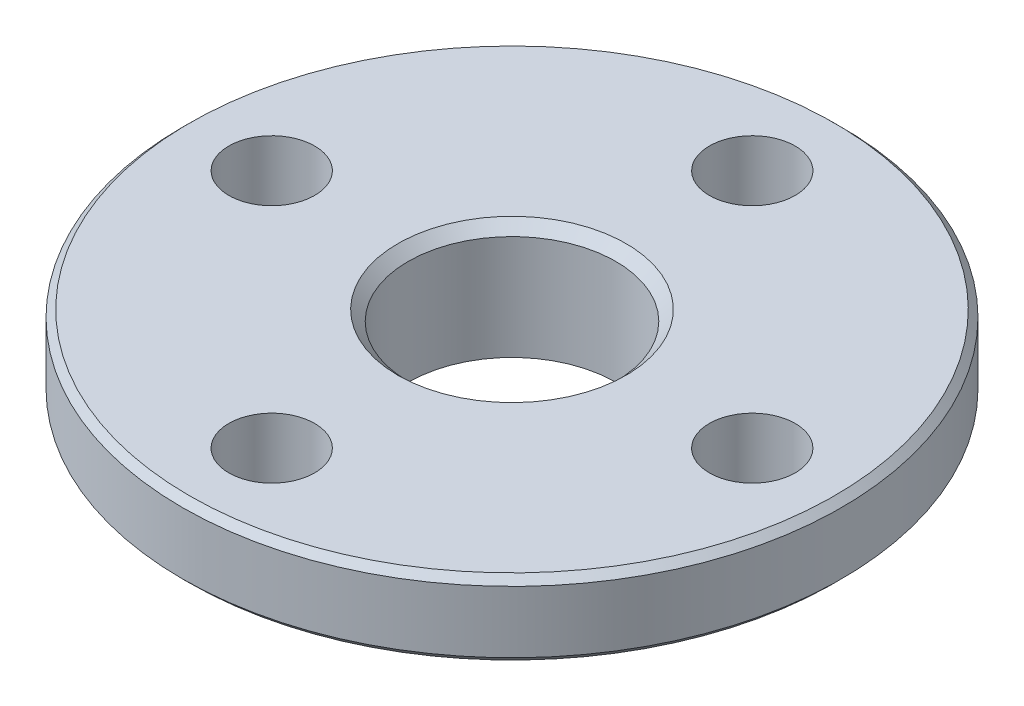
ISO-10303-21;
HEADER;
FILE_DESCRIPTION(('STEP AP214'),'2;1');
FILE_NAME('part.step','',(''),(''),'','','');
FILE_SCHEMA(('AUTOMOTIVE_DESIGN { 1 0 10303 214 1 1 1 1 }'));
ENDSEC;
DATA;
#1=APPLICATION_CONTEXT('core data for automotive mechanical design processes');
#2=APPLICATION_PROTOCOL_DEFINITION('international standard','automotive_design',2000,#1);
#3=PRODUCT_CONTEXT('',#1,'mechanical');
#4=PRODUCT('Part','Part','',(#3));
#5=PRODUCT_RELATED_PRODUCT_CATEGORY('part','',(#4));
#6=PRODUCT_DEFINITION_FORMATION('','',#4);
#7=PRODUCT_DEFINITION_CONTEXT('part definition',#1,'design');
#8=PRODUCT_DEFINITION('design','',#6,#7);
#9=PRODUCT_DEFINITION_SHAPE('','',#8);
#10=(LENGTH_UNIT() NAMED_UNIT(*) SI_UNIT(.MILLI.,.METRE.));
#11=(NAMED_UNIT(*) PLANE_ANGLE_UNIT() SI_UNIT($,.RADIAN.));
#12=(NAMED_UNIT(*) SI_UNIT($,.STERADIAN.) SOLID_ANGLE_UNIT());
#13=UNCERTAINTY_MEASURE_WITH_UNIT(LENGTH_MEASURE(1.E-05),#10,'distance_accuracy_value','');
#14=(GEOMETRIC_REPRESENTATION_CONTEXT(3) GLOBAL_UNCERTAINTY_ASSIGNED_CONTEXT((#13)) GLOBAL_UNIT_ASSIGNED_CONTEXT((#10,
#11,#12)) REPRESENTATION_CONTEXT('',''));
#15=CARTESIAN_POINT('',(0.,0.,0.));
#16=DIRECTION('',(0.,0.,1.));
#17=DIRECTION('',(1.,0.,0.));
#18=AXIS2_PLACEMENT_3D('',#15,#16,#17);
#19=CARTESIAN_POINT('',(3.0000018731,-21.738,0.));
#20=DIRECTION('',(0.,-1.,0.));
#21=DIRECTION('',(0.,0.,1.));
#22=AXIS2_PLACEMENT_3D('',#19,#20,#21);
#23=CYLINDRICAL_SURFACE('',#22,1.25);
#24=CARTESIAN_POINT('',(3.0000018731,-21.8,0.));
#25=DIRECTION('',(0.,1.,0.));
#26=DIRECTION('',(0.,0.,-1.));
#27=AXIS2_PLACEMENT_3D('',#24,#25,#26);
#28=CIRCLE('',#27,1.25);
#29=CARTESIAN_POINT('',(3.0000018731,-21.8,-1.25));
#30=VERTEX_POINT('',#29);
#31=EDGE_CURVE('E198',#30,#30,#28,.T.);
#32=ORIENTED_EDGE('',*,*,#31,.T.);
#33=DIRECTION('',(0.,-1.,0.));
#34=VECTOR('',#33,1.);
#35=CARTESIAN_POINT('',(3.0000018731,-21.738,-1.25));
#36=LINE('',#35,#34);
#37=CARTESIAN_POINT('',(3.0000018731,-24.,-1.25));
#38=VERTEX_POINT('',#37);
#39=EDGE_CURVE('E11',#30,#38,#36,.T.);
#40=ORIENTED_EDGE('',*,*,#39,.T.);
#41=CARTESIAN_POINT('',(3.0000018731,-24.,0.));
#42=DIRECTION('',(0.,-1.,0.));
#43=DIRECTION('',(0.,0.,1.));
#44=AXIS2_PLACEMENT_3D('',#41,#42,#43);
#45=CIRCLE('',#44,1.25);
#46=EDGE_CURVE('E209',#38,#38,#45,.T.);
#47=ORIENTED_EDGE('',*,*,#46,.T.);
#48=ORIENTED_EDGE('',*,*,#39,.F.);
#49=EDGE_LOOP('',(#32,#40,#47,#48));
#50=FACE_BOUND('',#49,.T.);
#51=ADVANCED_FACE('F17',(#50),#23,.F.);
#52=CARTESIAN_POINT('',(10.,-21.738,6.9999981269));
#53=DIRECTION('',(0.,-1.,0.));
#54=DIRECTION('',(1.,0.,0.));
#55=AXIS2_PLACEMENT_3D('',#52,#53,#54);
#56=CYLINDRICAL_SURFACE('',#55,1.25);
#57=CARTESIAN_POINT('',(10.,-21.8,6.9999981269));
#58=DIRECTION('',(0.,1.,0.));
#59=DIRECTION('',(-1.,0.,0.));
#60=AXIS2_PLACEMENT_3D('',#57,#58,#59);
#61=CIRCLE('',#60,1.25);
#62=CARTESIAN_POINT('',(8.75,-21.8,6.9999981269));
#63=VERTEX_POINT('',#62);
#64=EDGE_CURVE('E166',#63,#63,#61,.T.);
#65=ORIENTED_EDGE('',*,*,#64,.T.);
#66=DIRECTION('',(0.,-1.,0.));
#67=VECTOR('',#66,1.);
#68=CARTESIAN_POINT('',(8.75,-21.738,6.9999981269));
#69=LINE('',#68,#67);
#70=CARTESIAN_POINT('',(8.75,-24.,6.9999981269));
#71=VERTEX_POINT('',#70);
#72=EDGE_CURVE('E28',#63,#71,#69,.T.);
#73=ORIENTED_EDGE('',*,*,#72,.T.);
#74=CARTESIAN_POINT('',(10.,-24.,6.9999981269));
#75=DIRECTION('',(0.,-1.,0.));
#76=DIRECTION('',(1.,0.,0.));
#77=AXIS2_PLACEMENT_3D('',#74,#75,#76);
#78=CIRCLE('',#77,1.25);
#79=EDGE_CURVE('E226',#71,#71,#78,.T.);
#80=ORIENTED_EDGE('',*,*,#79,.T.);
#81=ORIENTED_EDGE('',*,*,#72,.F.);
#82=EDGE_LOOP('',(#65,#73,#80,#81));
#83=FACE_BOUND('',#82,.T.);
#84=ADVANCED_FACE('F238',(#83),#56,.F.);
#85=CARTESIAN_POINT('',(16.9999981269,-21.738,0.));
#86=DIRECTION('',(0.,-1.,0.));
#87=DIRECTION('',(0.,0.,-1.));
#88=AXIS2_PLACEMENT_3D('',#85,#86,#87);
#89=CYLINDRICAL_SURFACE('',#88,1.25);
#90=CARTESIAN_POINT('',(16.9999981269,-21.8,0.));
#91=DIRECTION('',(0.,1.,0.));
#92=DIRECTION('',(0.,0.,1.));
#93=AXIS2_PLACEMENT_3D('',#90,#91,#92);
#94=CIRCLE('',#93,1.25);
#95=CARTESIAN_POINT('',(16.9999981269,-21.8,1.25));
#96=VERTEX_POINT('',#95);
#97=EDGE_CURVE('E155',#96,#96,#94,.T.);
#98=ORIENTED_EDGE('',*,*,#97,.T.);
#99=DIRECTION('',(0.,-1.,0.));
#100=VECTOR('',#99,1.);
#101=CARTESIAN_POINT('',(16.9999981269,-21.738,1.25));
#102=LINE('',#101,#100);
#103=CARTESIAN_POINT('',(16.9999981269,-24.,1.25));
#104=VERTEX_POINT('',#103);
#105=EDGE_CURVE('E169',#96,#104,#102,.T.);
#106=ORIENTED_EDGE('',*,*,#105,.T.);
#107=CARTESIAN_POINT('',(16.9999981269,-24.,0.));
#108=DIRECTION('',(0.,-1.,0.));
#109=DIRECTION('',(0.,0.,-1.));
#110=AXIS2_PLACEMENT_3D('',#107,#108,#109);
#111=CIRCLE('',#110,1.25);
#112=EDGE_CURVE('E183',#104,#104,#111,.T.);
#113=ORIENTED_EDGE('',*,*,#112,.T.);
#114=ORIENTED_EDGE('',*,*,#105,.F.);
#115=EDGE_LOOP('',(#98,#106,#113,#114));
#116=FACE_BOUND('',#115,.T.);
#117=ADVANCED_FACE('F278',(#116),#89,.F.);
#118=CARTESIAN_POINT('',(10.,-21.738,-6.9999981269));
#119=DIRECTION('',(0.,-1.,0.));
#120=DIRECTION('',(-1.,0.,0.));
#121=AXIS2_PLACEMENT_3D('',#118,#119,#120);
#122=CYLINDRICAL_SURFACE('',#121,1.25);
#123=CARTESIAN_POINT('',(10.,-21.8,-6.9999981269));
#124=DIRECTION('',(0.,1.,0.));
#125=DIRECTION('',(1.,0.,0.));
#126=AXIS2_PLACEMENT_3D('',#123,#124,#125);
#127=CIRCLE('',#126,1.25);
#128=CARTESIAN_POINT('',(11.25,-21.8,-6.9999981269));
#129=VERTEX_POINT('',#128);
#130=EDGE_CURVE('E194',#129,#129,#127,.T.);
#131=ORIENTED_EDGE('',*,*,#130,.T.);
#132=DIRECTION('',(0.,-1.,0.));
#133=VECTOR('',#132,1.);
#134=CARTESIAN_POINT('',(11.25,-21.738,-6.9999981269));
#135=LINE('',#134,#133);
#136=CARTESIAN_POINT('',(11.25,-24.,-6.9999981269));
#137=VERTEX_POINT('',#136);
#138=EDGE_CURVE('E203',#129,#137,#135,.T.);
#139=ORIENTED_EDGE('',*,*,#138,.T.);
#140=CARTESIAN_POINT('',(10.,-24.,-6.9999981269));
#141=DIRECTION('',(0.,-1.,0.));
#142=DIRECTION('',(-1.,0.,0.));
#143=AXIS2_PLACEMENT_3D('',#140,#141,#142);
#144=CIRCLE('',#143,1.25);
#145=EDGE_CURVE('E180',#137,#137,#144,.T.);
#146=ORIENTED_EDGE('',*,*,#145,.T.);
#147=ORIENTED_EDGE('',*,*,#138,.F.);
#148=EDGE_LOOP('',(#131,#139,#146,#147));
#149=FACE_BOUND('',#148,.T.);
#150=ADVANCED_FACE('F243',(#149),#122,.F.);
#151=CARTESIAN_POINT('',(10.,-24.,0.));
#152=DIRECTION('',(0.,1.,0.));
#153=DIRECTION('',(1.,0.,0.));
#154=AXIS2_PLACEMENT_3D('',#151,#152,#153);
#155=PLANE('',#154);
#156=ORIENTED_EDGE('',*,*,#46,.F.);
#157=EDGE_LOOP('',(#156));
#158=FACE_BOUND('',#157,.T.);
#159=ORIENTED_EDGE('',*,*,#79,.F.);
#160=EDGE_LOOP('',(#159));
#161=FACE_BOUND('',#160,.T.);
#162=ORIENTED_EDGE('',*,*,#112,.F.);
#163=EDGE_LOOP('',(#162));
#164=FACE_BOUND('',#163,.T.);
#165=ORIENTED_EDGE('',*,*,#145,.F.);
#166=EDGE_LOOP('',(#165));
#167=FACE_BOUND('',#166,.T.);
#168=CARTESIAN_POINT('',(10.,-24.,0.));
#169=DIRECTION('',(0.,1.,0.));
#170=DIRECTION('',(1.,0.,0.));
#171=AXIS2_PLACEMENT_3D('',#168,#169,#170);
#172=CIRCLE('',#171,4.46);
#173=CARTESIAN_POINT('',(5.54,-24.,0.));
#174=VERTEX_POINT('',#173);
#175=EDGE_CURVE('E86',#174,#174,#172,.T.);
#176=ORIENTED_EDGE('',*,*,#175,.T.);
#177=EDGE_LOOP('',(#176));
#178=FACE_BOUND('',#177,.T.);
#179=CARTESIAN_POINT('',(10.,-24.,0.));
#180=DIRECTION('',(0.,1.,0.));
#181=DIRECTION('',(-1.,0.,0.));
#182=AXIS2_PLACEMENT_3D('',#179,#180,#181);
#183=CIRCLE('',#182,9.400000000004);
#184=CARTESIAN_POINT('',(10.,-24.,9.400000000004));
#185=VERTEX_POINT('',#184);
#186=EDGE_CURVE('E131',#185,#185,#183,.T.);
#187=ORIENTED_EDGE('',*,*,#186,.F.);
#188=EDGE_LOOP('',(#187));
#189=FACE_BOUND('',#188,.T.);
#190=ADVANCED_FACE('F240',(#158,#161,#164,#167,#178,#189),#155,.F.);
#191=CARTESIAN_POINT('',(10.,-23.9,0.));
#192=DIRECTION('',(0.,1.,0.));
#193=DIRECTION('',(0.,0.,-1.));
#194=AXIS2_PLACEMENT_3D('',#191,#192,#193);
#195=CONICAL_SURFACE('',#194,9.500000000004,0.785398163395354);
#196=CARTESIAN_POINT('',(10.,-23.8,0.));
#197=DIRECTION('',(0.,1.,0.));
#198=DIRECTION('',(-1.,0.,1.511103579004E-10));
#199=AXIS2_PLACEMENT_3D('',#196,#197,#198);
#200=CIRCLE('',#199,9.600000000004);
#201=CARTESIAN_POINT('',(10.,-23.8,9.600000000004));
#202=VERTEX_POINT('',#201);
#203=CARTESIAN_POINT('',(0.4,-23.8,0.));
#204=VERTEX_POINT('',#203);
#205=EDGE_CURVE('E137',#202,#204,#200,.T.);
#206=ORIENTED_EDGE('',*,*,#205,.F.);
#207=DIRECTION('',(0.,-0.707106781188028,-0.707106781185067));
#208=VECTOR('',#207,1.);
#209=CARTESIAN_POINT('',(10.,-23.9,9.500000000004));
#210=LINE('',#209,#208);
#211=EDGE_CURVE('E128',#202,#185,#210,.T.);
#212=ORIENTED_EDGE('',*,*,#211,.T.);
#213=ORIENTED_EDGE('',*,*,#186,.T.);
#214=ORIENTED_EDGE('',*,*,#211,.F.);
#215=CARTESIAN_POINT('',(10.,-23.8,0.));
#216=DIRECTION('',(0.,1.,0.));
#217=DIRECTION('',(-1.,0.,1.511103579004E-10));
#218=AXIS2_PLACEMENT_3D('',#215,#216,#217);
#219=CIRCLE('',#218,9.600000000004);
#220=EDGE_CURVE('E123',#204,#202,#219,.T.);
#221=ORIENTED_EDGE('',*,*,#220,.F.);
#222=EDGE_LOOP('',(#206,#212,#213,#214,#221));
#223=FACE_BOUND('',#222,.T.);
#224=ADVANCED_FACE('F129',(#223),#195,.T.);
#225=CARTESIAN_POINT('',(10.,-21.946,0.));
#226=DIRECTION('',(0.,-1.,0.));
#227=DIRECTION('',(1.,0.,0.));
#228=AXIS2_PLACEMENT_3D('',#225,#226,#227);
#229=CYLINDRICAL_SURFACE('',#228,9.6);
#230=ORIENTED_EDGE('',*,*,#205,.T.);
#231=DIRECTION('',(0.,1.,0.));
#232=VECTOR('',#231,1.);
#233=CARTESIAN_POINT('',(0.4,-21.946,0.));
#234=LINE('',#233,#232);
#235=CARTESIAN_POINT('',(0.4,-22.,0.));
#236=VERTEX_POINT('',#235);
#237=EDGE_CURVE('E139',#204,#236,#234,.T.);
#238=ORIENTED_EDGE('',*,*,#237,.T.);
#239=CARTESIAN_POINT('',(10.,-22.,0.));
#240=DIRECTION('',(0.,-1.,0.));
#241=DIRECTION('',(0.,0.,1.));
#242=AXIS2_PLACEMENT_3D('',#239,#240,#241);
#243=CIRCLE('',#242,9.600000000002);
#244=CARTESIAN_POINT('',(10.,-22.,9.60000000000213));
#245=VERTEX_POINT('',#244);
#246=EDGE_CURVE('E162',#236,#245,#243,.T.);
#247=ORIENTED_EDGE('',*,*,#246,.T.);
#248=CARTESIAN_POINT('',(10.,-22.,0.));
#249=DIRECTION('',(0.,-1.,0.));
#250=DIRECTION('',(0.,0.,1.));
#251=AXIS2_PLACEMENT_3D('',#248,#249,#250);
#252=CIRCLE('',#251,9.600000000002);
#253=EDGE_CURVE('E152',#245,#236,#252,.T.);
#254=ORIENTED_EDGE('',*,*,#253,.T.);
#255=ORIENTED_EDGE('',*,*,#237,.F.);
#256=ORIENTED_EDGE('',*,*,#220,.T.);
#257=EDGE_LOOP('',(#230,#238,#247,#254,#255,#256));
#258=FACE_BOUND('',#257,.T.);
#259=ADVANCED_FACE('F136',(#258),#229,.T.);
#260=CARTESIAN_POINT('',(10.,-21.9,0.));
#261=DIRECTION('',(0.,-1.,0.));
#262=DIRECTION('',(0.,0.,-1.));
#263=AXIS2_PLACEMENT_3D('',#260,#261,#262);
#264=CONICAL_SURFACE('',#263,9.499999999999,0.78539816341368);
#265=ORIENTED_EDGE('',*,*,#246,.F.);
#266=ORIENTED_EDGE('',*,*,#253,.F.);
#267=DIRECTION('',(0.,0.70710678117507,-0.707106781198025));
#268=VECTOR('',#267,1.);
#269=CARTESIAN_POINT('',(10.,-21.9,9.499999999999));
#270=LINE('',#269,#268);
#271=CARTESIAN_POINT('',(10.,-21.8000000000006,9.39999999999638));
#272=VERTEX_POINT('',#271);
#273=EDGE_CURVE('E143',#245,#272,#270,.T.);
#274=ORIENTED_EDGE('',*,*,#273,.T.);
#275=CARTESIAN_POINT('',(10.,-21.8,0.));
#276=DIRECTION('',(0.,-1.,0.));
#277=DIRECTION('',(-1.,0.,0.));
#278=AXIS2_PLACEMENT_3D('',#275,#276,#277);
#279=CIRCLE('',#278,9.399999999997);
#280=EDGE_CURVE('E173',#272,#272,#279,.T.);
#281=ORIENTED_EDGE('',*,*,#280,.T.);
#282=ORIENTED_EDGE('',*,*,#273,.F.);
#283=EDGE_LOOP('',(#265,#266,#274,#281,#282));
#284=FACE_BOUND('',#283,.T.);
#285=ADVANCED_FACE('F19',(#284),#264,.T.);
#286=CARTESIAN_POINT('',(10.,-21.8,0.));
#287=DIRECTION('',(0.,1.,0.));
#288=DIRECTION('',(1.,0.,0.));
#289=AXIS2_PLACEMENT_3D('',#286,#287,#288);
#290=PLANE('',#289);
#291=CARTESIAN_POINT('',(10.,-21.8,0.));
#292=DIRECTION('',(0.,1.,0.));
#293=DIRECTION('',(-1.,0.,0.));
#294=AXIS2_PLACEMENT_3D('',#291,#292,#293);
#295=CIRCLE('',#294,3.325000000003);
#296=CARTESIAN_POINT('',(10.,-21.8,3.325000000003));
#297=VERTEX_POINT('',#296);
#298=EDGE_CURVE('E170',#297,#297,#295,.T.);
#299=ORIENTED_EDGE('',*,*,#298,.F.);
#300=EDGE_LOOP('',(#299));
#301=FACE_BOUND('',#300,.T.);
#302=ORIENTED_EDGE('',*,*,#64,.F.);
#303=EDGE_LOOP('',(#302));
#304=FACE_BOUND('',#303,.T.);
#305=ORIENTED_EDGE('',*,*,#31,.F.);
#306=EDGE_LOOP('',(#305));
#307=FACE_BOUND('',#306,.T.);
#308=ORIENTED_EDGE('',*,*,#130,.F.);
#309=EDGE_LOOP('',(#308));
#310=FACE_BOUND('',#309,.T.);
#311=ORIENTED_EDGE('',*,*,#97,.F.);
#312=EDGE_LOOP('',(#311));
#313=FACE_BOUND('',#312,.T.);
#314=ORIENTED_EDGE('',*,*,#280,.F.);
#315=EDGE_LOOP('',(#314));
#316=FACE_BOUND('',#315,.T.);
#317=ADVANCED_FACE('F253',(#301,#304,#307,#310,#313,#316),#290,.T.);
#318=CARTESIAN_POINT('',(10.,-21.95,0.));
#319=DIRECTION('',(0.,1.,0.));
#320=DIRECTION('',(0.,0.,-1.));
#321=AXIS2_PLACEMENT_3D('',#318,#319,#320);
#322=CONICAL_SURFACE('',#321,3.175,0.785398163408968);
#323=CARTESIAN_POINT('',(10.,-22.1,0.));
#324=DIRECTION('',(0.,1.,0.));
#325=DIRECTION('',(-1.,0.,-1.218757202866E-10));
#326=AXIS2_PLACEMENT_3D('',#323,#324,#325);
#327=CIRCLE('',#326,3.024999999997);
#328=CARTESIAN_POINT('',(10.,-22.1,3.024999999997));
#329=VERTEX_POINT('',#328);
#330=CARTESIAN_POINT('',(6.975,-22.1,0.));
#331=VERTEX_POINT('',#330);
#332=EDGE_CURVE('E158',#329,#331,#327,.T.);
#333=ORIENTED_EDGE('',*,*,#332,.F.);
#334=DIRECTION('',(0.,0.707106781178402,0.707106781194693));
#335=VECTOR('',#334,1.);
#336=CARTESIAN_POINT('',(10.,-21.95,3.175));
#337=LINE('',#336,#335);
#338=EDGE_CURVE('E174',#329,#297,#337,.T.);
#339=ORIENTED_EDGE('',*,*,#338,.T.);
#340=ORIENTED_EDGE('',*,*,#298,.T.);
#341=ORIENTED_EDGE('',*,*,#338,.F.);
#342=CARTESIAN_POINT('',(10.,-22.1,0.));
#343=DIRECTION('',(0.,1.,0.));
#344=DIRECTION('',(-1.,0.,-1.218757202866E-10));
#345=AXIS2_PLACEMENT_3D('',#342,#343,#344);
#346=CIRCLE('',#345,3.024999999997);
#347=EDGE_CURVE('E193',#331,#329,#346,.T.);
#348=ORIENTED_EDGE('',*,*,#347,.F.);
#349=EDGE_LOOP('',(#333,#339,#340,#341,#348));
#350=FACE_BOUND('',#349,.T.);
#351=ADVANCED_FACE('F256',(#350),#322,.F.);
#352=CARTESIAN_POINT('',(10.,-22.044,0.));
#353=DIRECTION('',(0.,-1.,0.));
#354=DIRECTION('',(1.,0.,0.));
#355=AXIS2_PLACEMENT_3D('',#352,#353,#354);
#356=CYLINDRICAL_SURFACE('',#355,3.025);
#357=ORIENTED_EDGE('',*,*,#332,.T.);
#358=DIRECTION('',(0.,-1.,0.));
#359=VECTOR('',#358,1.);
#360=CARTESIAN_POINT('',(6.975,-22.044,0.));
#361=LINE('',#360,#359);
#362=CARTESIAN_POINT('',(6.975,-25.15,0.));
#363=VERTEX_POINT('',#362);
#364=EDGE_CURVE('E21',#331,#363,#361,.T.);
#365=ORIENTED_EDGE('',*,*,#364,.T.);
#366=CARTESIAN_POINT('',(10.,-25.15,0.));
#367=DIRECTION('',(0.,1.,0.));
#368=DIRECTION('',(-1.,0.,0.));
#369=AXIS2_PLACEMENT_3D('',#366,#367,#368);
#370=CIRCLE('',#369,3.025);
#371=EDGE_CURVE('E161',#363,#363,#370,.T.);
#372=ORIENTED_EDGE('',*,*,#371,.F.);
#373=ORIENTED_EDGE('',*,*,#364,.F.);
#374=ORIENTED_EDGE('',*,*,#347,.T.);
#375=EDGE_LOOP('',(#357,#365,#372,#373,#374));
#376=FACE_BOUND('',#375,.T.);
#377=ADVANCED_FACE('F281',(#376),#356,.F.);
#378=CARTESIAN_POINT('',(10.,-25.1500023711079,0.));
#379=DIRECTION('',(0.,-1.,0.));
#380=DIRECTION('',(-1.,0.,0.));
#381=AXIS2_PLACEMENT_3D('',#378,#379,#380);
#382=PLANE('',#381);
#383=ORIENTED_EDGE('',*,*,#371,.T.);
#384=EDGE_LOOP('',(#383));
#385=FACE_BOUND('',#384,.T.);
#386=CARTESIAN_POINT('',(10.,-25.15,0.));
#387=DIRECTION('',(0.,-1.,0.));
#388=DIRECTION('',(1.,0.,0.));
#389=AXIS2_PLACEMENT_3D('',#386,#387,#388);
#390=CIRCLE('',#389,4.46);
#391=CARTESIAN_POINT('',(5.54,-25.15,0.));
#392=VERTEX_POINT('',#391);
#393=EDGE_CURVE('E175',#392,#392,#390,.T.);
#394=ORIENTED_EDGE('',*,*,#393,.T.);
#395=EDGE_LOOP('',(#394));
#396=FACE_BOUND('',#395,.T.);
#397=ADVANCED_FACE('F296',(#385,#396),#382,.T.);
#398=CARTESIAN_POINT('',(10.,-24.,0.));
#399=DIRECTION('',(0.,-1.,0.));
#400=DIRECTION('',(1.,0.,0.));
#401=AXIS2_PLACEMENT_3D('',#398,#399,#400);
#402=CYLINDRICAL_SURFACE('',#401,4.46);
#403=ORIENTED_EDGE('',*,*,#393,.F.);
#404=DIRECTION('',(0.,1.,0.));
#405=VECTOR('',#404,1.);
#406=CARTESIAN_POINT('',(5.54,-24.,0.));
#407=LINE('',#406,#405);
#408=EDGE_CURVE('E178',#392,#174,#407,.T.);
#409=ORIENTED_EDGE('',*,*,#408,.T.);
#410=ORIENTED_EDGE('',*,*,#175,.F.);
#411=ORIENTED_EDGE('',*,*,#408,.F.);
#412=EDGE_LOOP('',(#403,#409,#410,#411));
#413=FACE_BOUND('',#412,.T.);
#414=ADVANCED_FACE('F299',(#413),#402,.T.);
#415=CLOSED_SHELL('',(#51,#84,#117,#150,#190,#224,#259,#285,#317,#351,#377,#397,#414));
#416=MANIFOLD_SOLID_BREP('B1',#415);
#417=ADVANCED_BREP_SHAPE_REPRESENTATION('',(#18,#416),#14);
#418=SHAPE_DEFINITION_REPRESENTATION(#9,#417);
ENDSEC;
END-ISO-10303-21;
